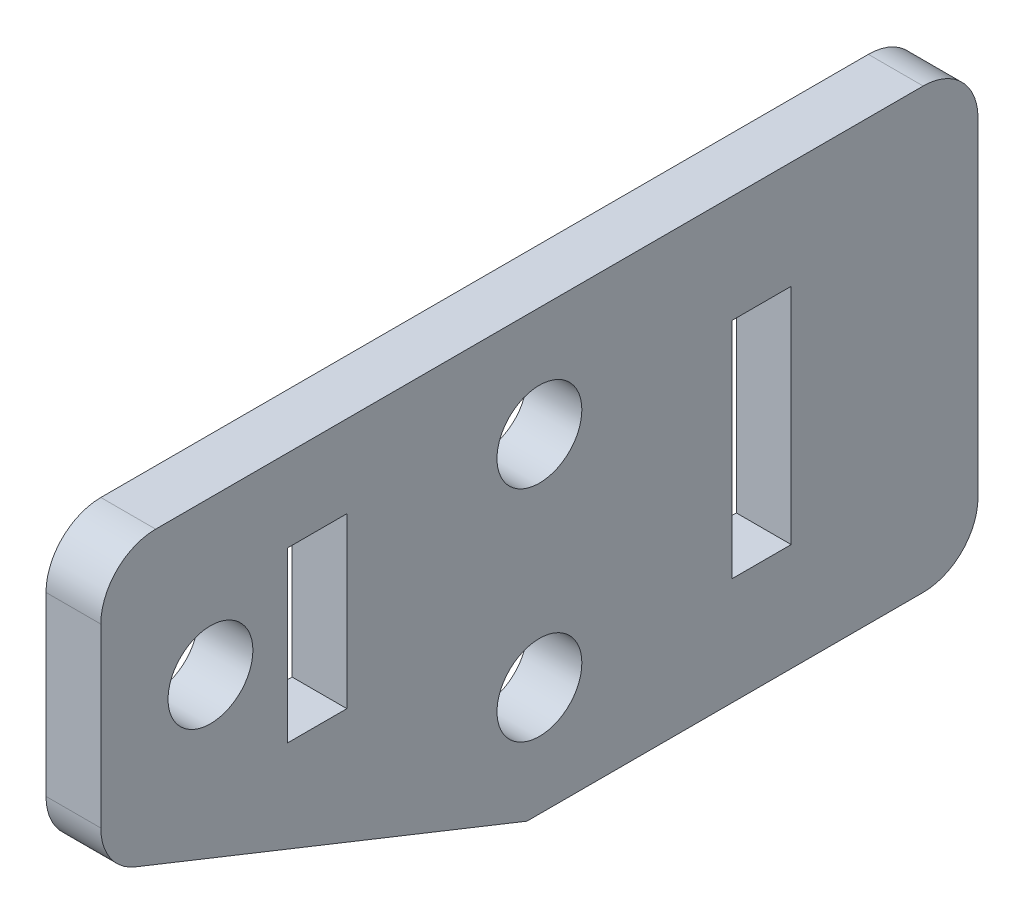
ISO-10303-21;
HEADER;
FILE_DESCRIPTION(('STEP AP214'),'2;1');
FILE_NAME('part.step','',(''),(''),'','','');
FILE_SCHEMA(('AUTOMOTIVE_DESIGN { 1 0 10303 214 1 1 1 1 }'));
ENDSEC;
DATA;
#1=APPLICATION_CONTEXT('core data for automotive mechanical design processes');
#2=APPLICATION_PROTOCOL_DEFINITION('international standard','automotive_design',2000,#1);
#3=PRODUCT_CONTEXT('',#1,'mechanical');
#4=PRODUCT('Part','Part','',(#3));
#5=PRODUCT_RELATED_PRODUCT_CATEGORY('part','',(#4));
#6=PRODUCT_DEFINITION_FORMATION('','',#4);
#7=PRODUCT_DEFINITION_CONTEXT('part definition',#1,'design');
#8=PRODUCT_DEFINITION('design','',#6,#7);
#9=PRODUCT_DEFINITION_SHAPE('','',#8);
#10=(LENGTH_UNIT() NAMED_UNIT(*) SI_UNIT(.MILLI.,.METRE.));
#11=(NAMED_UNIT(*) PLANE_ANGLE_UNIT() SI_UNIT($,.RADIAN.));
#12=(NAMED_UNIT(*) SI_UNIT($,.STERADIAN.) SOLID_ANGLE_UNIT());
#13=UNCERTAINTY_MEASURE_WITH_UNIT(LENGTH_MEASURE(1.E-05),#10,'distance_accuracy_value','');
#14=(GEOMETRIC_REPRESENTATION_CONTEXT(3) GLOBAL_UNCERTAINTY_ASSIGNED_CONTEXT((#13)) GLOBAL_UNIT_ASSIGNED_CONTEXT((#10,
#11,#12)) REPRESENTATION_CONTEXT('',''));
#15=CARTESIAN_POINT('',(0.,0.,0.));
#16=DIRECTION('',(0.,0.,1.));
#17=DIRECTION('',(1.,0.,0.));
#18=AXIS2_PLACEMENT_3D('',#15,#16,#17);
#19=CARTESIAN_POINT('',(3.175,0.,0.));
#20=DIRECTION('',(-1.,0.,0.));
#21=DIRECTION('',(0.,0.,1.));
#22=AXIS2_PLACEMENT_3D('',#19,#20,#21);
#23=PLANE('',#22);
#24=CARTESIAN_POINT('',(3.175,3.81,19.05));
#25=DIRECTION('',(1.,0.,0.));
#26=DIRECTION('',(0.,0.,-1.));
#27=AXIS2_PLACEMENT_3D('',#24,#25,#26);
#28=CIRCLE('',#27,2.45745);
#29=CARTESIAN_POINT('',(3.175,3.81,16.59255));
#30=VERTEX_POINT('',#29);
#31=EDGE_CURVE('E415',#30,#30,#28,.T.);
#32=ORIENTED_EDGE('',*,*,#31,.F.);
#33=EDGE_LOOP('',(#32));
#34=FACE_BOUND('',#33,.T.);
#35=CARTESIAN_POINT('',(3.175,-6.35,0.));
#36=DIRECTION('',(1.,0.,0.));
#37=DIRECTION('',(0.,0.,-1.));
#38=AXIS2_PLACEMENT_3D('',#35,#36,#37);
#39=CIRCLE('',#38,2.45745);
#40=CARTESIAN_POINT('',(3.175,-6.35,-2.45745));
#41=VERTEX_POINT('',#40);
#42=EDGE_CURVE('E417',#41,#41,#39,.T.);
#43=ORIENTED_EDGE('',*,*,#42,.F.);
#44=EDGE_LOOP('',(#43));
#45=FACE_BOUND('',#44,.T.);
#46=DIRECTION('',(0.,0.,-1.));
#47=VECTOR('',#46,1.);
#48=CARTESIAN_POINT('',(3.175,-1.8415,14.5796));
#49=LINE('',#48,#47);
#50=CARTESIAN_POINT('',(3.175,-1.8415,14.5796));
#51=VERTEX_POINT('',#50);
#52=CARTESIAN_POINT('',(3.175,-1.8415,11.1506));
#53=VERTEX_POINT('',#52);
#54=EDGE_CURVE('E190',#51,#53,#49,.T.);
#55=ORIENTED_EDGE('',*,*,#54,.F.);
#56=DIRECTION('',(0.,-1.,0.));
#57=VECTOR('',#56,1.);
#58=CARTESIAN_POINT('',(3.175,-1.8415,14.5796));
#59=LINE('',#58,#57);
#60=CARTESIAN_POINT('',(3.175,7.9375,14.5796));
#61=VERTEX_POINT('',#60);
#62=EDGE_CURVE('E54',#61,#51,#59,.T.);
#63=ORIENTED_EDGE('',*,*,#62,.F.);
#64=DIRECTION('',(0.,0.,1.));
#65=VECTOR('',#64,1.);
#66=CARTESIAN_POINT('',(3.175,7.9375,14.5796));
#67=LINE('',#66,#65);
#68=CARTESIAN_POINT('',(3.175,7.9375,11.1506));
#69=VERTEX_POINT('',#68);
#70=EDGE_CURVE('E178',#69,#61,#67,.T.);
#71=ORIENTED_EDGE('',*,*,#70,.F.);
#72=DIRECTION('',(0.,1.,0.));
#73=VECTOR('',#72,1.);
#74=CARTESIAN_POINT('',(3.175,-1.8415,11.1506));
#75=LINE('',#74,#73);
#76=EDGE_CURVE('E181',#53,#69,#75,.T.);
#77=ORIENTED_EDGE('',*,*,#76,.F.);
#78=EDGE_LOOP('',(#55,#63,#71,#77));
#79=FACE_BOUND('',#78,.T.);
#80=DIRECTION('',(0.,0.,-1.));
#81=VECTOR('',#80,1.);
#82=CARTESIAN_POINT('',(3.175,-6.477,-11.1506));
#83=LINE('',#82,#81);
#84=CARTESIAN_POINT('',(3.175,-6.477,-11.1506));
#85=VERTEX_POINT('',#84);
#86=CARTESIAN_POINT('',(3.175,-6.477,-14.5796));
#87=VERTEX_POINT('',#86);
#88=EDGE_CURVE('E216',#85,#87,#83,.T.);
#89=ORIENTED_EDGE('',*,*,#88,.F.);
#90=DIRECTION('',(0.,-1.,0.));
#91=VECTOR('',#90,1.);
#92=CARTESIAN_POINT('',(3.175,-6.477,-11.1506));
#93=LINE('',#92,#91);
#94=CARTESIAN_POINT('',(3.175,6.477,-11.1506));
#95=VERTEX_POINT('',#94);
#96=EDGE_CURVE('E62',#95,#85,#93,.T.);
#97=ORIENTED_EDGE('',*,*,#96,.F.);
#98=DIRECTION('',(0.,0.,1.));
#99=VECTOR('',#98,1.);
#100=CARTESIAN_POINT('',(3.175,6.477,-11.1506));
#101=LINE('',#100,#99);
#102=CARTESIAN_POINT('',(3.175,6.477,-14.5796));
#103=VERTEX_POINT('',#102);
#104=EDGE_CURVE('E205',#103,#95,#101,.T.);
#105=ORIENTED_EDGE('',*,*,#104,.F.);
#106=DIRECTION('',(0.,1.,0.));
#107=VECTOR('',#106,1.);
#108=CARTESIAN_POINT('',(3.175,-6.477,-14.5796));
#109=LINE('',#108,#107);
#110=EDGE_CURVE('E219',#87,#103,#109,.T.);
#111=ORIENTED_EDGE('',*,*,#110,.F.);
#112=EDGE_LOOP('',(#89,#97,#105,#111));
#113=FACE_BOUND('',#112,.T.);
#114=DIRECTION('',(0.,0.,-1.));
#115=VECTOR('',#114,1.);
#116=CARTESIAN_POINT('',(3.175,-12.7,25.4));
#117=LINE('',#116,#115);
#118=CARTESIAN_POINT('',(3.175,-12.7,0.719569845181661));
#119=VERTEX_POINT('',#118);
#120=CARTESIAN_POINT('',(3.175,-12.7,-22.225));
#121=VERTEX_POINT('',#120);
#122=EDGE_CURVE('E239',#119,#121,#117,.T.);
#123=ORIENTED_EDGE('',*,*,#122,.T.);
#124=CARTESIAN_POINT('',(3.175,-9.525,-22.225));
#125=DIRECTION('',(-1.,0.,0.));
#126=DIRECTION('',(0.,0.,1.));
#127=AXIS2_PLACEMENT_3D('',#124,#125,#126);
#128=CIRCLE('',#127,3.175);
#129=CARTESIAN_POINT('',(3.175,-9.525,-25.4));
#130=VERTEX_POINT('',#129);
#131=EDGE_CURVE('E282',#121,#130,#128,.F.);
#132=ORIENTED_EDGE('',*,*,#131,.T.);
#133=DIRECTION('',(0.,1.,0.));
#134=VECTOR('',#133,1.);
#135=CARTESIAN_POINT('',(3.175,-12.7,-25.4));
#136=LINE('',#135,#134);
#137=CARTESIAN_POINT('',(3.175,9.525,-25.4));
#138=VERTEX_POINT('',#137);
#139=EDGE_CURVE('E243',#130,#138,#136,.T.);
#140=ORIENTED_EDGE('',*,*,#139,.T.);
#141=CARTESIAN_POINT('',(3.175,9.525,-22.225));
#142=DIRECTION('',(-1.,0.,0.));
#143=DIRECTION('',(0.,0.,1.));
#144=AXIS2_PLACEMENT_3D('',#141,#142,#143);
#145=CIRCLE('',#144,3.175);
#146=CARTESIAN_POINT('',(3.175,12.7,-22.225));
#147=VERTEX_POINT('',#146);
#148=EDGE_CURVE('E280',#138,#147,#145,.F.);
#149=ORIENTED_EDGE('',*,*,#148,.T.);
#150=DIRECTION('',(0.,0.,1.));
#151=VECTOR('',#150,1.);
#152=CARTESIAN_POINT('',(3.175,12.7,25.4));
#153=LINE('',#152,#151);
#154=CARTESIAN_POINT('',(3.175,12.7,22.225));
#155=VERTEX_POINT('',#154);
#156=EDGE_CURVE('E246',#147,#155,#153,.T.);
#157=ORIENTED_EDGE('',*,*,#156,.T.);
#158=CARTESIAN_POINT('',(3.175,9.525,22.225));
#159=DIRECTION('',(-1.,0.,0.));
#160=DIRECTION('',(0.,0.,1.));
#161=AXIS2_PLACEMENT_3D('',#158,#159,#160);
#162=CIRCLE('',#161,3.175);
#163=CARTESIAN_POINT('',(3.175,9.525,25.4));
#164=VERTEX_POINT('',#163);
#165=EDGE_CURVE('E278',#155,#164,#162,.F.);
#166=ORIENTED_EDGE('',*,*,#165,.T.);
#167=DIRECTION('',(0.,-1.,0.));
#168=VECTOR('',#167,1.);
#169=CARTESIAN_POINT('',(3.175,-12.7,25.4));
#170=LINE('',#169,#168);
#171=CARTESIAN_POINT('',(3.175,-0.703717106092546,25.4));
#172=VERTEX_POINT('',#171);
#173=EDGE_CURVE('E236',#164,#172,#170,.T.);
#174=ORIENTED_EDGE('',*,*,#173,.T.);
#175=CARTESIAN_POINT('',(3.175,-0.703717106092546,22.225));
#176=DIRECTION('',(-1.,0.,0.));
#177=DIRECTION('',(0.,0.,1.));
#178=AXIS2_PLACEMENT_3D('',#175,#176,#177);
#179=CIRCLE('',#178,3.175);
#180=CARTESIAN_POINT('',(3.175,-3.65277101708831,23.4013103459719));
#181=VERTEX_POINT('',#180);
#182=EDGE_CURVE('E276',#172,#181,#179,.F.);
#183=ORIENTED_EDGE('',*,*,#182,.T.);
#184=DIRECTION('',(0.,0.370491447550212,0.928835877478981));
#185=VECTOR('',#184,1.);
#186=CARTESIAN_POINT('',(3.175,-4.05065103295691,22.4038103061888));
#187=LINE('',#186,#185);
#188=EDGE_CURVE('E197',#119,#181,#187,.T.);
#189=ORIENTED_EDGE('',*,*,#188,.F.);
#190=EDGE_LOOP('',(#123,#132,#140,#149,#157,#166,#174,#183,#189));
#191=FACE_BOUND('',#190,.T.);
#192=CARTESIAN_POINT('',(3.175,6.35,0.));
#193=DIRECTION('',(1.,0.,0.));
#194=DIRECTION('',(0.,0.,-1.));
#195=AXIS2_PLACEMENT_3D('',#192,#193,#194);
#196=CIRCLE('',#195,2.45745);
#197=CARTESIAN_POINT('',(3.175,6.35,-2.45745));
#198=VERTEX_POINT('',#197);
#199=EDGE_CURVE('E424',#198,#198,#196,.T.);
#200=ORIENTED_EDGE('',*,*,#199,.F.);
#201=EDGE_LOOP('',(#200));
#202=FACE_BOUND('',#201,.T.);
#203=ADVANCED_FACE('F39',(#34,#45,#79,#113,#191,#202),#23,.F.);
#204=CARTESIAN_POINT('',(0.,0.,0.));
#205=DIRECTION('',(-1.,0.,0.));
#206=DIRECTION('',(0.,0.,1.));
#207=AXIS2_PLACEMENT_3D('',#204,#205,#206);
#208=PLANE('',#207);
#209=CARTESIAN_POINT('',(0.,3.81,19.05));
#210=DIRECTION('',(1.,0.,0.));
#211=DIRECTION('',(0.,0.,-1.));
#212=AXIS2_PLACEMENT_3D('',#209,#210,#211);
#213=CIRCLE('',#212,2.45745);
#214=CARTESIAN_POINT('',(0.,3.81,16.59255));
#215=VERTEX_POINT('',#214);
#216=EDGE_CURVE('E413',#215,#215,#213,.T.);
#217=ORIENTED_EDGE('',*,*,#216,.T.);
#218=EDGE_LOOP('',(#217));
#219=FACE_BOUND('',#218,.T.);
#220=CARTESIAN_POINT('',(0.,-6.35,0.));
#221=DIRECTION('',(1.,0.,0.));
#222=DIRECTION('',(0.,0.,-1.));
#223=AXIS2_PLACEMENT_3D('',#220,#221,#222);
#224=CIRCLE('',#223,2.45745);
#225=CARTESIAN_POINT('',(0.,-6.35,-2.45745));
#226=VERTEX_POINT('',#225);
#227=EDGE_CURVE('E422',#226,#226,#224,.T.);
#228=ORIENTED_EDGE('',*,*,#227,.T.);
#229=EDGE_LOOP('',(#228));
#230=FACE_BOUND('',#229,.T.);
#231=DIRECTION('',(0.,1.,0.));
#232=VECTOR('',#231,1.);
#233=CARTESIAN_POINT('',(0.,-12.7,-25.4));
#234=LINE('',#233,#232);
#235=CARTESIAN_POINT('',(0.,-9.525,-25.4));
#236=VERTEX_POINT('',#235);
#237=CARTESIAN_POINT('',(0.,9.525,-25.4));
#238=VERTEX_POINT('',#237);
#239=EDGE_CURVE('E255',#236,#238,#234,.T.);
#240=ORIENTED_EDGE('',*,*,#239,.F.);
#241=CARTESIAN_POINT('',(0.,-9.525,-22.225));
#242=DIRECTION('',(-1.,0.,0.));
#243=DIRECTION('',(0.,0.,1.));
#244=AXIS2_PLACEMENT_3D('',#241,#242,#243);
#245=CIRCLE('',#244,3.175);
#246=CARTESIAN_POINT('',(0.,-12.7,-22.225));
#247=VERTEX_POINT('',#246);
#248=EDGE_CURVE('E272',#236,#247,#245,.T.);
#249=ORIENTED_EDGE('',*,*,#248,.T.);
#250=DIRECTION('',(0.,0.,-1.));
#251=VECTOR('',#250,1.);
#252=CARTESIAN_POINT('',(0.,-12.7,25.4));
#253=LINE('',#252,#251);
#254=CARTESIAN_POINT('',(0.,-12.7000000000009,0.719569845182034));
#255=VERTEX_POINT('',#254);
#256=EDGE_CURVE('E252',#255,#247,#253,.T.);
#257=ORIENTED_EDGE('',*,*,#256,.F.);
#258=DIRECTION('',(0.,-0.370491447550212,-0.928835877478981));
#259=VECTOR('',#258,1.);
#260=CARTESIAN_POINT('',(0.,-11.2043708203856,4.46916798196995));
#261=LINE('',#260,#259);
#262=CARTESIAN_POINT('',(0.,-3.65277101708831,23.4013103459719));
#263=VERTEX_POINT('',#262);
#264=EDGE_CURVE('E249',#263,#255,#261,.T.);
#265=ORIENTED_EDGE('',*,*,#264,.F.);
#266=CARTESIAN_POINT('',(0.,-0.703717106092546,22.225));
#267=DIRECTION('',(-1.,0.,0.));
#268=DIRECTION('',(0.,0.,1.));
#269=AXIS2_PLACEMENT_3D('',#266,#267,#268);
#270=CIRCLE('',#269,3.175);
#271=CARTESIAN_POINT('',(0.,-0.703717106092546,25.4));
#272=VERTEX_POINT('',#271);
#273=EDGE_CURVE('E266',#263,#272,#270,.T.);
#274=ORIENTED_EDGE('',*,*,#273,.T.);
#275=DIRECTION('',(0.,-1.,0.));
#276=VECTOR('',#275,1.);
#277=CARTESIAN_POINT('',(0.,-12.7,25.4));
#278=LINE('',#277,#276);
#279=CARTESIAN_POINT('',(0.,9.525,25.4));
#280=VERTEX_POINT('',#279);
#281=EDGE_CURVE('E235',#280,#272,#278,.T.);
#282=ORIENTED_EDGE('',*,*,#281,.F.);
#283=CARTESIAN_POINT('',(0.,9.525,22.225));
#284=DIRECTION('',(-1.,0.,0.));
#285=DIRECTION('',(0.,0.,1.));
#286=AXIS2_PLACEMENT_3D('',#283,#284,#285);
#287=CIRCLE('',#286,3.175);
#288=CARTESIAN_POINT('',(0.,12.7,22.225));
#289=VERTEX_POINT('',#288);
#290=EDGE_CURVE('E268',#280,#289,#287,.T.);
#291=ORIENTED_EDGE('',*,*,#290,.T.);
#292=DIRECTION('',(0.,0.,1.));
#293=VECTOR('',#292,1.);
#294=CARTESIAN_POINT('',(0.,12.7,25.4));
#295=LINE('',#294,#293);
#296=CARTESIAN_POINT('',(0.,12.7,-22.225));
#297=VERTEX_POINT('',#296);
#298=EDGE_CURVE('E240',#297,#289,#295,.T.);
#299=ORIENTED_EDGE('',*,*,#298,.F.);
#300=CARTESIAN_POINT('',(0.,9.525,-22.225));
#301=DIRECTION('',(-1.,0.,0.));
#302=DIRECTION('',(0.,0.,1.));
#303=AXIS2_PLACEMENT_3D('',#300,#301,#302);
#304=CIRCLE('',#303,3.175);
#305=EDGE_CURVE('E270',#297,#238,#304,.T.);
#306=ORIENTED_EDGE('',*,*,#305,.T.);
#307=EDGE_LOOP('',(#240,#249,#257,#265,#274,#282,#291,#299,#306));
#308=FACE_BOUND('',#307,.T.);
#309=DIRECTION('',(0.,-1.,0.));
#310=VECTOR('',#309,1.);
#311=CARTESIAN_POINT('',(0.,-6.477,-11.1506));
#312=LINE('',#311,#310);
#313=CARTESIAN_POINT('',(0.,6.477,-11.1506));
#314=VERTEX_POINT('',#313);
#315=CARTESIAN_POINT('',(0.,-6.477,-11.1506));
#316=VERTEX_POINT('',#315);
#317=EDGE_CURVE('E201',#314,#316,#312,.T.);
#318=ORIENTED_EDGE('',*,*,#317,.T.);
#319=DIRECTION('',(0.,0.,-1.));
#320=VECTOR('',#319,1.);
#321=CARTESIAN_POINT('',(0.,-6.477,-11.1506));
#322=LINE('',#321,#320);
#323=CARTESIAN_POINT('',(0.,-6.477,-14.5796));
#324=VERTEX_POINT('',#323);
#325=EDGE_CURVE('E204',#316,#324,#322,.T.);
#326=ORIENTED_EDGE('',*,*,#325,.T.);
#327=DIRECTION('',(0.,1.,0.));
#328=VECTOR('',#327,1.);
#329=CARTESIAN_POINT('',(0.,-6.477,-14.5796));
#330=LINE('',#329,#328);
#331=CARTESIAN_POINT('',(0.,6.477,-14.5796));
#332=VERTEX_POINT('',#331);
#333=EDGE_CURVE('E208',#324,#332,#330,.T.);
#334=ORIENTED_EDGE('',*,*,#333,.T.);
#335=DIRECTION('',(0.,0.,1.));
#336=VECTOR('',#335,1.);
#337=CARTESIAN_POINT('',(0.,6.477,-11.1506));
#338=LINE('',#337,#336);
#339=EDGE_CURVE('E211',#332,#314,#338,.T.);
#340=ORIENTED_EDGE('',*,*,#339,.T.);
#341=EDGE_LOOP('',(#318,#326,#334,#340));
#342=FACE_BOUND('',#341,.T.);
#343=DIRECTION('',(0.,-1.,0.));
#344=VECTOR('',#343,1.);
#345=CARTESIAN_POINT('',(0.,-1.8415,14.5796));
#346=LINE('',#345,#344);
#347=CARTESIAN_POINT('',(0.,7.9375,14.5796));
#348=VERTEX_POINT('',#347);
#349=CARTESIAN_POINT('',(0.,-1.8415,14.5796));
#350=VERTEX_POINT('',#349);
#351=EDGE_CURVE('E159',#348,#350,#346,.T.);
#352=ORIENTED_EDGE('',*,*,#351,.T.);
#353=DIRECTION('',(0.,0.,-1.));
#354=VECTOR('',#353,1.);
#355=CARTESIAN_POINT('',(0.,-1.8415,14.5796));
#356=LINE('',#355,#354);
#357=CARTESIAN_POINT('',(0.,-1.8415,11.1506));
#358=VERTEX_POINT('',#357);
#359=EDGE_CURVE('E169',#350,#358,#356,.T.);
#360=ORIENTED_EDGE('',*,*,#359,.T.);
#361=DIRECTION('',(0.,1.,0.));
#362=VECTOR('',#361,1.);
#363=CARTESIAN_POINT('',(0.,-1.8415,11.1506));
#364=LINE('',#363,#362);
#365=CARTESIAN_POINT('',(0.,7.9375,11.1506));
#366=VERTEX_POINT('',#365);
#367=EDGE_CURVE('E173',#358,#366,#364,.T.);
#368=ORIENTED_EDGE('',*,*,#367,.T.);
#369=DIRECTION('',(0.,0.,1.));
#370=VECTOR('',#369,1.);
#371=CARTESIAN_POINT('',(0.,7.9375,14.5796));
#372=LINE('',#371,#370);
#373=EDGE_CURVE('E165',#366,#348,#372,.T.);
#374=ORIENTED_EDGE('',*,*,#373,.T.);
#375=EDGE_LOOP('',(#352,#360,#368,#374));
#376=FACE_BOUND('',#375,.T.);
#377=CARTESIAN_POINT('',(0.,6.35,0.));
#378=DIRECTION('',(1.,0.,0.));
#379=DIRECTION('',(0.,0.,-1.));
#380=AXIS2_PLACEMENT_3D('',#377,#378,#379);
#381=CIRCLE('',#380,2.45745);
#382=CARTESIAN_POINT('',(0.,6.35,-2.45745));
#383=VERTEX_POINT('',#382);
#384=EDGE_CURVE('E184',#383,#383,#381,.T.);
#385=ORIENTED_EDGE('',*,*,#384,.T.);
#386=EDGE_LOOP('',(#385));
#387=FACE_BOUND('',#386,.T.);
#388=ADVANCED_FACE('F175',(#219,#230,#308,#342,#376,#387),#208,.T.);
#389=CARTESIAN_POINT('',(3.175,-12.7,25.4));
#390=DIRECTION('',(0.,0.,-1.));
#391=DIRECTION('',(-1.,0.,0.));
#392=AXIS2_PLACEMENT_3D('',#389,#390,#391);
#393=PLANE('',#392);
#394=ORIENTED_EDGE('',*,*,#173,.F.);
#395=DIRECTION('',(-1.,0.,0.));
#396=VECTOR('',#395,1.);
#397=CARTESIAN_POINT('',(3.175,9.525,25.4));
#398=LINE('',#397,#396);
#399=EDGE_CURVE('E47',#164,#280,#398,.T.);
#400=ORIENTED_EDGE('',*,*,#399,.T.);
#401=ORIENTED_EDGE('',*,*,#281,.T.);
#402=DIRECTION('',(1.,0.,0.));
#403=VECTOR('',#402,1.);
#404=CARTESIAN_POINT('',(3.175,-0.703717106092546,25.4));
#405=LINE('',#404,#403);
#406=EDGE_CURVE('E289',#272,#172,#405,.T.);
#407=ORIENTED_EDGE('',*,*,#406,.T.);
#408=EDGE_LOOP('',(#394,#400,#401,#407));
#409=FACE_BOUND('',#408,.T.);
#410=ADVANCED_FACE('F296',(#409),#393,.F.);
#411=CARTESIAN_POINT('',(3.175,-12.7,25.4));
#412=DIRECTION('',(0.,1.,0.));
#413=DIRECTION('',(0.,0.,1.));
#414=AXIS2_PLACEMENT_3D('',#411,#412,#413);
#415=PLANE('',#414);
#416=ORIENTED_EDGE('',*,*,#256,.T.);
#417=DIRECTION('',(-1.,0.,0.));
#418=VECTOR('',#417,1.);
#419=CARTESIAN_POINT('',(3.175,-12.7,-22.225));
#420=LINE('',#419,#418);
#421=EDGE_CURVE('E274',#247,#121,#420,.F.);
#422=ORIENTED_EDGE('',*,*,#421,.T.);
#423=ORIENTED_EDGE('',*,*,#122,.F.);
#424=DIRECTION('',(-1.,0.,0.));
#425=VECTOR('',#424,1.);
#426=CARTESIAN_POINT('',(3.175,-12.7,0.719569845181667));
#427=LINE('',#426,#425);
#428=EDGE_CURVE('E232',#119,#255,#427,.T.);
#429=ORIENTED_EDGE('',*,*,#428,.T.);
#430=EDGE_LOOP('',(#416,#422,#423,#429));
#431=FACE_BOUND('',#430,.T.);
#432=ADVANCED_FACE('F331',(#431),#415,.F.);
#433=CARTESIAN_POINT('',(3.175,-12.7,-25.4));
#434=DIRECTION('',(0.,0.,1.));
#435=DIRECTION('',(1.,0.,0.));
#436=AXIS2_PLACEMENT_3D('',#433,#434,#435);
#437=PLANE('',#436);
#438=ORIENTED_EDGE('',*,*,#139,.F.);
#439=DIRECTION('',(-1.,0.,0.));
#440=VECTOR('',#439,1.);
#441=CARTESIAN_POINT('',(3.175,-9.525,-25.4));
#442=LINE('',#441,#440);
#443=EDGE_CURVE('E263',#130,#236,#442,.T.);
#444=ORIENTED_EDGE('',*,*,#443,.T.);
#445=ORIENTED_EDGE('',*,*,#239,.T.);
#446=DIRECTION('',(-1.,0.,0.));
#447=VECTOR('',#446,1.);
#448=CARTESIAN_POINT('',(3.175,9.525,-25.4));
#449=LINE('',#448,#447);
#450=EDGE_CURVE('E261',#238,#138,#449,.F.);
#451=ORIENTED_EDGE('',*,*,#450,.T.);
#452=EDGE_LOOP('',(#438,#444,#445,#451));
#453=FACE_BOUND('',#452,.T.);
#454=ADVANCED_FACE('F322',(#453),#437,.F.);
#455=CARTESIAN_POINT('',(3.175,12.7,25.4));
#456=DIRECTION('',(0.,-1.,0.));
#457=DIRECTION('',(0.,0.,-1.));
#458=AXIS2_PLACEMENT_3D('',#455,#456,#457);
#459=PLANE('',#458);
#460=ORIENTED_EDGE('',*,*,#156,.F.);
#461=DIRECTION('',(-1.,0.,0.));
#462=VECTOR('',#461,1.);
#463=CARTESIAN_POINT('',(3.175,12.7,-22.225));
#464=LINE('',#463,#462);
#465=EDGE_CURVE('E286',#147,#297,#464,.T.);
#466=ORIENTED_EDGE('',*,*,#465,.T.);
#467=ORIENTED_EDGE('',*,*,#298,.T.);
#468=DIRECTION('',(-1.,0.,0.));
#469=VECTOR('',#468,1.);
#470=CARTESIAN_POINT('',(3.175,12.7,22.225));
#471=LINE('',#470,#469);
#472=EDGE_CURVE('E284',#289,#155,#471,.F.);
#473=ORIENTED_EDGE('',*,*,#472,.T.);
#474=EDGE_LOOP('',(#460,#466,#467,#473));
#475=FACE_BOUND('',#474,.T.);
#476=ADVANCED_FACE('F316',(#475),#459,.F.);
#477=CARTESIAN_POINT('',(0.,-4.05065103295691,22.4038103061888));
#478=DIRECTION('',(0.,0.928835877478981,-0.370491447550212));
#479=DIRECTION('',(0.,0.370491447550212,0.928835877478981));
#480=AXIS2_PLACEMENT_3D('',#477,#478,#479);
#481=PLANE('',#480);
#482=ORIENTED_EDGE('',*,*,#188,.T.);
#483=DIRECTION('',(1.,0.,0.));
#484=VECTOR('',#483,1.);
#485=CARTESIAN_POINT('',(0.,-3.65277101708831,23.4013103459719));
#486=LINE('',#485,#484);
#487=EDGE_CURVE('E11',#181,#263,#486,.F.);
#488=ORIENTED_EDGE('',*,*,#487,.T.);
#489=ORIENTED_EDGE('',*,*,#264,.T.);
#490=ORIENTED_EDGE('',*,*,#428,.F.);
#491=EDGE_LOOP('',(#482,#488,#489,#490));
#492=FACE_BOUND('',#491,.T.);
#493=ADVANCED_FACE('F334',(#492),#481,.F.);
#494=CARTESIAN_POINT('',(3.175,-9.525,-22.225));
#495=DIRECTION('',(-1.,0.,0.));
#496=DIRECTION('',(0.,0.,1.));
#497=AXIS2_PLACEMENT_3D('',#494,#495,#496);
#498=CYLINDRICAL_SURFACE('',#497,3.175);
#499=ORIENTED_EDGE('',*,*,#131,.F.);
#500=ORIENTED_EDGE('',*,*,#421,.F.);
#501=ORIENTED_EDGE('',*,*,#248,.F.);
#502=ORIENTED_EDGE('',*,*,#443,.F.);
#503=EDGE_LOOP('',(#499,#500,#501,#502));
#504=FACE_BOUND('',#503,.T.);
#505=ADVANCED_FACE('F328',(#504),#498,.T.);
#506=CARTESIAN_POINT('',(3.175,9.525,-22.225));
#507=DIRECTION('',(-1.,0.,0.));
#508=DIRECTION('',(0.,0.,1.));
#509=AXIS2_PLACEMENT_3D('',#506,#507,#508);
#510=CYLINDRICAL_SURFACE('',#509,3.175);
#511=ORIENTED_EDGE('',*,*,#148,.F.);
#512=ORIENTED_EDGE('',*,*,#450,.F.);
#513=ORIENTED_EDGE('',*,*,#305,.F.);
#514=ORIENTED_EDGE('',*,*,#465,.F.);
#515=EDGE_LOOP('',(#511,#512,#513,#514));
#516=FACE_BOUND('',#515,.T.);
#517=ADVANCED_FACE('F325',(#516),#510,.T.);
#518=CARTESIAN_POINT('',(3.175,9.525,22.225));
#519=DIRECTION('',(-1.,0.,0.));
#520=DIRECTION('',(0.,0.,1.));
#521=AXIS2_PLACEMENT_3D('',#518,#519,#520);
#522=CYLINDRICAL_SURFACE('',#521,3.175);
#523=ORIENTED_EDGE('',*,*,#165,.F.);
#524=ORIENTED_EDGE('',*,*,#472,.F.);
#525=ORIENTED_EDGE('',*,*,#290,.F.);
#526=ORIENTED_EDGE('',*,*,#399,.F.);
#527=EDGE_LOOP('',(#523,#524,#525,#526));
#528=FACE_BOUND('',#527,.T.);
#529=ADVANCED_FACE('F314',(#528),#522,.T.);
#530=CARTESIAN_POINT('',(3.175,-0.703717106092546,22.225));
#531=DIRECTION('',(1.,0.,0.));
#532=DIRECTION('',(0.,0.,-1.));
#533=AXIS2_PLACEMENT_3D('',#530,#531,#532);
#534=CYLINDRICAL_SURFACE('',#533,3.175);
#535=ORIENTED_EDGE('',*,*,#273,.F.);
#536=ORIENTED_EDGE('',*,*,#487,.F.);
#537=ORIENTED_EDGE('',*,*,#182,.F.);
#538=ORIENTED_EDGE('',*,*,#406,.F.);
#539=EDGE_LOOP('',(#535,#536,#537,#538));
#540=FACE_BOUND('',#539,.T.);
#541=ADVANCED_FACE('F41',(#540),#534,.T.);
#542=CARTESIAN_POINT('',(0.,-6.477,-11.1506));
#543=DIRECTION('',(0.,0.,1.));
#544=DIRECTION('',(0.,-1.,0.));
#545=AXIS2_PLACEMENT_3D('',#542,#543,#544);
#546=PLANE('',#545);
#547=ORIENTED_EDGE('',*,*,#96,.T.);
#548=DIRECTION('',(1.,0.,0.));
#549=VECTOR('',#548,1.);
#550=CARTESIAN_POINT('',(0.,-6.477,-11.1506));
#551=LINE('',#550,#549);
#552=EDGE_CURVE('E214',#316,#85,#551,.T.);
#553=ORIENTED_EDGE('',*,*,#552,.F.);
#554=ORIENTED_EDGE('',*,*,#317,.F.);
#555=DIRECTION('',(1.,0.,0.));
#556=VECTOR('',#555,1.);
#557=CARTESIAN_POINT('',(0.,6.477,-11.1506));
#558=LINE('',#557,#556);
#559=EDGE_CURVE('E191',#314,#95,#558,.T.);
#560=ORIENTED_EDGE('',*,*,#559,.T.);
#561=EDGE_LOOP('',(#547,#553,#554,#560));
#562=FACE_BOUND('',#561,.T.);
#563=ADVANCED_FACE('F366',(#562),#546,.F.);
#564=CARTESIAN_POINT('',(0.,6.477,-11.1506));
#565=DIRECTION('',(0.,1.,0.));
#566=DIRECTION('',(0.,0.,1.));
#567=AXIS2_PLACEMENT_3D('',#564,#565,#566);
#568=PLANE('',#567);
#569=ORIENTED_EDGE('',*,*,#104,.T.);
#570=ORIENTED_EDGE('',*,*,#559,.F.);
#571=ORIENTED_EDGE('',*,*,#339,.F.);
#572=DIRECTION('',(1.,0.,0.));
#573=VECTOR('',#572,1.);
#574=CARTESIAN_POINT('',(0.,6.477,-14.5796));
#575=LINE('',#574,#573);
#576=EDGE_CURVE('E225',#332,#103,#575,.T.);
#577=ORIENTED_EDGE('',*,*,#576,.T.);
#578=EDGE_LOOP('',(#569,#570,#571,#577));
#579=FACE_BOUND('',#578,.T.);
#580=ADVANCED_FACE('F370',(#579),#568,.F.);
#581=CARTESIAN_POINT('',(0.,-6.477,-14.5796));
#582=DIRECTION('',(0.,0.,-1.));
#583=DIRECTION('',(0.,1.,0.));
#584=AXIS2_PLACEMENT_3D('',#581,#582,#583);
#585=PLANE('',#584);
#586=ORIENTED_EDGE('',*,*,#110,.T.);
#587=ORIENTED_EDGE('',*,*,#576,.F.);
#588=ORIENTED_EDGE('',*,*,#333,.F.);
#589=DIRECTION('',(1.,0.,0.));
#590=VECTOR('',#589,1.);
#591=CARTESIAN_POINT('',(0.,-6.477,-14.5796));
#592=LINE('',#591,#590);
#593=EDGE_CURVE('E227',#324,#87,#592,.T.);
#594=ORIENTED_EDGE('',*,*,#593,.T.);
#595=EDGE_LOOP('',(#586,#587,#588,#594));
#596=FACE_BOUND('',#595,.T.);
#597=ADVANCED_FACE('F374',(#596),#585,.F.);
#598=CARTESIAN_POINT('',(0.,-6.477,-11.1506));
#599=DIRECTION('',(0.,-1.,0.));
#600=DIRECTION('',(0.,0.,-1.));
#601=AXIS2_PLACEMENT_3D('',#598,#599,#600);
#602=PLANE('',#601);
#603=ORIENTED_EDGE('',*,*,#88,.T.);
#604=ORIENTED_EDGE('',*,*,#593,.F.);
#605=ORIENTED_EDGE('',*,*,#325,.F.);
#606=ORIENTED_EDGE('',*,*,#552,.T.);
#607=EDGE_LOOP('',(#603,#604,#605,#606));
#608=FACE_BOUND('',#607,.T.);
#609=ADVANCED_FACE('F378',(#608),#602,.F.);
#610=CARTESIAN_POINT('',(0.,-1.8415,14.5796));
#611=DIRECTION('',(0.,0.,1.));
#612=DIRECTION('',(1.,0.,0.));
#613=AXIS2_PLACEMENT_3D('',#610,#611,#612);
#614=PLANE('',#613);
#615=ORIENTED_EDGE('',*,*,#62,.T.);
#616=DIRECTION('',(1.,0.,0.));
#617=VECTOR('',#616,1.);
#618=CARTESIAN_POINT('',(0.,-1.8415,14.5796));
#619=LINE('',#618,#617);
#620=EDGE_CURVE('E155',#350,#51,#619,.T.);
#621=ORIENTED_EDGE('',*,*,#620,.F.);
#622=ORIENTED_EDGE('',*,*,#351,.F.);
#623=DIRECTION('',(1.,0.,0.));
#624=VECTOR('',#623,1.);
#625=CARTESIAN_POINT('',(0.,7.9375,14.5796));
#626=LINE('',#625,#624);
#627=EDGE_CURVE('E195',#348,#61,#626,.T.);
#628=ORIENTED_EDGE('',*,*,#627,.T.);
#629=EDGE_LOOP('',(#615,#621,#622,#628));
#630=FACE_BOUND('',#629,.T.);
#631=ADVANCED_FACE('F157',(#630),#614,.F.);
#632=CARTESIAN_POINT('',(0.,7.9375,14.5796));
#633=DIRECTION('',(0.,1.,0.));
#634=DIRECTION('',(0.,0.,1.));
#635=AXIS2_PLACEMENT_3D('',#632,#633,#634);
#636=PLANE('',#635);
#637=ORIENTED_EDGE('',*,*,#70,.T.);
#638=ORIENTED_EDGE('',*,*,#627,.F.);
#639=ORIENTED_EDGE('',*,*,#373,.F.);
#640=DIRECTION('',(1.,0.,0.));
#641=VECTOR('',#640,1.);
#642=CARTESIAN_POINT('',(0.,7.9375,11.1506));
#643=LINE('',#642,#641);
#644=EDGE_CURVE('E198',#366,#69,#643,.T.);
#645=ORIENTED_EDGE('',*,*,#644,.T.);
#646=EDGE_LOOP('',(#637,#638,#639,#645));
#647=FACE_BOUND('',#646,.T.);
#648=ADVANCED_FACE('F387',(#647),#636,.F.);
#649=CARTESIAN_POINT('',(0.,-1.8415,11.1506));
#650=DIRECTION('',(0.,0.,-1.));
#651=DIRECTION('',(0.,1.,0.));
#652=AXIS2_PLACEMENT_3D('',#649,#650,#651);
#653=PLANE('',#652);
#654=ORIENTED_EDGE('',*,*,#76,.T.);
#655=ORIENTED_EDGE('',*,*,#644,.F.);
#656=ORIENTED_EDGE('',*,*,#367,.F.);
#657=DIRECTION('',(1.,0.,0.));
#658=VECTOR('',#657,1.);
#659=CARTESIAN_POINT('',(0.,-1.8415,11.1506));
#660=LINE('',#659,#658);
#661=EDGE_CURVE('E164',#358,#53,#660,.T.);
#662=ORIENTED_EDGE('',*,*,#661,.T.);
#663=EDGE_LOOP('',(#654,#655,#656,#662));
#664=FACE_BOUND('',#663,.T.);
#665=ADVANCED_FACE('F391',(#664),#653,.F.);
#666=CARTESIAN_POINT('',(0.,-1.8415,14.5796));
#667=DIRECTION('',(0.,-1.,0.));
#668=DIRECTION('',(0.,0.,-1.));
#669=AXIS2_PLACEMENT_3D('',#666,#667,#668);
#670=PLANE('',#669);
#671=ORIENTED_EDGE('',*,*,#54,.T.);
#672=ORIENTED_EDGE('',*,*,#661,.F.);
#673=ORIENTED_EDGE('',*,*,#359,.F.);
#674=ORIENTED_EDGE('',*,*,#620,.T.);
#675=EDGE_LOOP('',(#671,#672,#673,#674));
#676=FACE_BOUND('',#675,.T.);
#677=ADVANCED_FACE('F170',(#676),#670,.F.);
#678=CARTESIAN_POINT('',(3.175,6.35,0.));
#679=DIRECTION('',(1.,0.,0.));
#680=DIRECTION('',(0.,0.,-1.));
#681=AXIS2_PLACEMENT_3D('',#678,#679,#680);
#682=CYLINDRICAL_SURFACE('',#681,2.45745);
#683=ORIENTED_EDGE('',*,*,#384,.F.);
#684=EDGE_LOOP('',(#683));
#685=FACE_BOUND('',#684,.T.);
#686=ORIENTED_EDGE('',*,*,#199,.T.);
#687=EDGE_LOOP('',(#686));
#688=FACE_BOUND('',#687,.T.);
#689=ADVANCED_FACE('F390',(#685,#688),#682,.F.);
#690=CARTESIAN_POINT('',(3.175,-6.35,0.));
#691=DIRECTION('',(1.,0.,0.));
#692=DIRECTION('',(0.,0.,-1.));
#693=AXIS2_PLACEMENT_3D('',#690,#691,#692);
#694=CYLINDRICAL_SURFACE('',#693,2.45745);
#695=ORIENTED_EDGE('',*,*,#227,.F.);
#696=EDGE_LOOP('',(#695));
#697=FACE_BOUND('',#696,.T.);
#698=ORIENTED_EDGE('',*,*,#42,.T.);
#699=EDGE_LOOP('',(#698));
#700=FACE_BOUND('',#699,.T.);
#701=ADVANCED_FACE('F400',(#697,#700),#694,.F.);
#702=CARTESIAN_POINT('',(3.175,3.81,19.05));
#703=DIRECTION('',(1.,0.,0.));
#704=DIRECTION('',(0.,0.,-1.));
#705=AXIS2_PLACEMENT_3D('',#702,#703,#704);
#706=CYLINDRICAL_SURFACE('',#705,2.45745);
#707=ORIENTED_EDGE('',*,*,#216,.F.);
#708=EDGE_LOOP('',(#707));
#709=FACE_BOUND('',#708,.T.);
#710=ORIENTED_EDGE('',*,*,#31,.T.);
#711=EDGE_LOOP('',(#710));
#712=FACE_BOUND('',#711,.T.);
#713=ADVANCED_FACE('F404',(#709,#712),#706,.F.);
#714=CLOSED_SHELL('',(#203,#388,#410,#432,#454,#476,#493,#505,#517,#529,#541,#563,#580,#597,
#609,#631,#648,#665,#677,#689,#701,#713));
#715=MANIFOLD_SOLID_BREP('B2',#714);
#716=ADVANCED_BREP_SHAPE_REPRESENTATION('',(#18,#715),#14);
#717=SHAPE_DEFINITION_REPRESENTATION(#9,#716);
ENDSEC;
END-ISO-10303-21;
